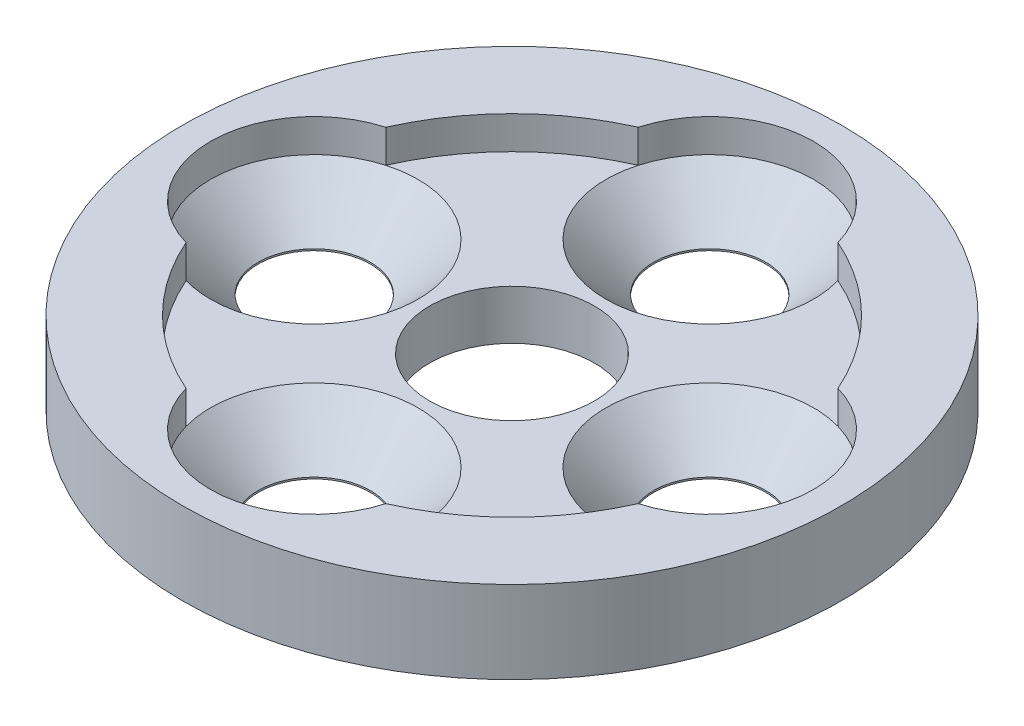
ISO-10303-21;
HEADER;
FILE_DESCRIPTION(('STEP AP214'),'2;1');
FILE_NAME('part.step','',(''),(''),'','','');
FILE_SCHEMA(('AUTOMOTIVE_DESIGN { 1 0 10303 214 1 1 1 1 }'));
ENDSEC;
DATA;
#1=APPLICATION_CONTEXT('core data for automotive mechanical design processes');
#2=APPLICATION_PROTOCOL_DEFINITION('international standard','automotive_design',2000,#1);
#3=PRODUCT_CONTEXT('',#1,'mechanical');
#4=PRODUCT('Part','Part','',(#3));
#5=PRODUCT_RELATED_PRODUCT_CATEGORY('part','',(#4));
#6=PRODUCT_DEFINITION_FORMATION('','',#4);
#7=PRODUCT_DEFINITION_CONTEXT('part definition',#1,'design');
#8=PRODUCT_DEFINITION('design','',#6,#7);
#9=PRODUCT_DEFINITION_SHAPE('','',#8);
#10=(LENGTH_UNIT() NAMED_UNIT(*) SI_UNIT(.MILLI.,.METRE.));
#11=(NAMED_UNIT(*) PLANE_ANGLE_UNIT() SI_UNIT($,.RADIAN.));
#12=(NAMED_UNIT(*) SI_UNIT($,.STERADIAN.) SOLID_ANGLE_UNIT());
#13=UNCERTAINTY_MEASURE_WITH_UNIT(LENGTH_MEASURE(1.E-05),#10,'distance_accuracy_value','');
#14=(GEOMETRIC_REPRESENTATION_CONTEXT(3) GLOBAL_UNCERTAINTY_ASSIGNED_CONTEXT((#13)) GLOBAL_UNIT_ASSIGNED_CONTEXT((#10,
#11,#12)) REPRESENTATION_CONTEXT('',''));
#15=CARTESIAN_POINT('',(0.,0.,0.));
#16=DIRECTION('',(0.,0.,1.));
#17=DIRECTION('',(1.,0.,0.));
#18=AXIS2_PLACEMENT_3D('',#15,#16,#17);
#19=CARTESIAN_POINT('',(0.,2.5,0.));
#20=DIRECTION('',(0.,-1.,0.));
#21=DIRECTION('',(0.,0.,-1.));
#22=AXIS2_PLACEMENT_3D('',#19,#20,#21);
#23=CYLINDRICAL_SURFACE('',#22,7.5);
#24=CARTESIAN_POINT('',(0.,2.5,0.));
#25=DIRECTION('',(0.,1.,0.));
#26=DIRECTION('',(0.,0.,1.));
#27=AXIS2_PLACEMENT_3D('',#24,#25,#26);
#28=CIRCLE('',#27,7.5);
#29=CARTESIAN_POINT('',(-3.03015257196317,2.5,-6.860625));
#30=VERTEX_POINT('',#29);
#31=CARTESIAN_POINT('',(-6.860625,2.5,-3.03015257196317));
#32=VERTEX_POINT('',#31);
#33=EDGE_CURVE('E124',#30,#32,#28,.T.);
#34=ORIENTED_EDGE('',*,*,#33,.T.);
#35=DIRECTION('',(0.,-1.,0.));
#36=VECTOR('',#35,1.);
#37=CARTESIAN_POINT('',(-6.860625,12.,-3.03015257196317));
#38=LINE('',#37,#36);
#39=CARTESIAN_POINT('',(-6.860625,1.5,-3.03015257196317));
#40=VERTEX_POINT('',#39);
#41=EDGE_CURVE('E108',#32,#40,#38,.T.);
#42=ORIENTED_EDGE('',*,*,#41,.T.);
#43=CARTESIAN_POINT('',(0.,1.5,0.));
#44=DIRECTION('',(0.,1.,0.));
#45=DIRECTION('',(0.,0.,1.));
#46=AXIS2_PLACEMENT_3D('',#43,#44,#45);
#47=CIRCLE('',#46,7.5);
#48=CARTESIAN_POINT('',(-3.03015257196317,1.5,-6.860625));
#49=VERTEX_POINT('',#48);
#50=EDGE_CURVE('E48',#40,#49,#47,.F.);
#51=ORIENTED_EDGE('',*,*,#50,.T.);
#52=DIRECTION('',(0.,-1.,0.));
#53=VECTOR('',#52,1.);
#54=CARTESIAN_POINT('',(-3.03015257196317,12.,-6.860625));
#55=LINE('',#54,#53);
#56=EDGE_CURVE('E56',#49,#30,#55,.F.);
#57=ORIENTED_EDGE('',*,*,#56,.T.);
#58=EDGE_LOOP('',(#34,#42,#51,#57));
#59=FACE_BOUND('',#58,.T.);
#60=ADVANCED_FACE('F38',(#59),#23,.F.);
#61=CARTESIAN_POINT('',(-3.03015257196317,1.5,6.860625));
#62=VERTEX_POINT('',#61);
#63=CARTESIAN_POINT('',(-6.860625,1.5,3.03015257196317));
#64=VERTEX_POINT('',#63);
#65=EDGE_CURVE('E11',#62,#64,#47,.F.);
#66=ORIENTED_EDGE('',*,*,#65,.T.);
#67=DIRECTION('',(0.,-1.,0.));
#68=VECTOR('',#67,1.);
#69=CARTESIAN_POINT('',(-6.860625,12.,3.03015257196317));
#70=LINE('',#69,#68);
#71=CARTESIAN_POINT('',(-6.860625,2.5,3.03015257196317));
#72=VERTEX_POINT('',#71);
#73=EDGE_CURVE('E111',#64,#72,#70,.F.);
#74=ORIENTED_EDGE('',*,*,#73,.T.);
#75=CARTESIAN_POINT('',(-3.03015257196317,2.5,6.860625));
#76=VERTEX_POINT('',#75);
#77=EDGE_CURVE('E155',#72,#76,#28,.T.);
#78=ORIENTED_EDGE('',*,*,#77,.T.);
#79=DIRECTION('',(0.,-1.,0.));
#80=VECTOR('',#79,1.);
#81=CARTESIAN_POINT('',(-3.03015257196317,12.,6.860625));
#82=LINE('',#81,#80);
#83=EDGE_CURVE('E132',#76,#62,#82,.T.);
#84=ORIENTED_EDGE('',*,*,#83,.T.);
#85=EDGE_LOOP('',(#66,#74,#78,#84));
#86=FACE_BOUND('',#85,.T.);
#87=ADVANCED_FACE('F262',(#86),#23,.F.);
#88=CARTESIAN_POINT('',(6.860625,1.5,3.03015257196317));
#89=VERTEX_POINT('',#88);
#90=CARTESIAN_POINT('',(3.03015257196317,1.5,6.860625));
#91=VERTEX_POINT('',#90);
#92=EDGE_CURVE('E49',#89,#91,#47,.F.);
#93=ORIENTED_EDGE('',*,*,#92,.T.);
#94=DIRECTION('',(0.,-1.,0.));
#95=VECTOR('',#94,1.);
#96=CARTESIAN_POINT('',(3.03015257196317,12.,6.860625));
#97=LINE('',#96,#95);
#98=CARTESIAN_POINT('',(3.03015257196317,2.5,6.860625));
#99=VERTEX_POINT('',#98);
#100=EDGE_CURVE('E207',#91,#99,#97,.F.);
#101=ORIENTED_EDGE('',*,*,#100,.T.);
#102=CARTESIAN_POINT('',(6.860625,2.5,3.03015257196317));
#103=VERTEX_POINT('',#102);
#104=EDGE_CURVE('E150',#99,#103,#28,.T.);
#105=ORIENTED_EDGE('',*,*,#104,.T.);
#106=DIRECTION('',(0.,-1.,0.));
#107=VECTOR('',#106,1.);
#108=CARTESIAN_POINT('',(6.860625,12.,3.03015257196317));
#109=LINE('',#108,#107);
#110=EDGE_CURVE('E211',#103,#89,#109,.T.);
#111=ORIENTED_EDGE('',*,*,#110,.T.);
#112=EDGE_LOOP('',(#93,#101,#105,#111));
#113=FACE_BOUND('',#112,.T.);
#114=ADVANCED_FACE('F268',(#113),#23,.F.);
#115=CARTESIAN_POINT('',(6.860625,2.5,-3.03015257196317));
#116=VERTEX_POINT('',#115);
#117=CARTESIAN_POINT('',(3.03015257196317,2.5,-6.860625));
#118=VERTEX_POINT('',#117);
#119=EDGE_CURVE('E154',#116,#118,#28,.T.);
#120=ORIENTED_EDGE('',*,*,#119,.T.);
#121=DIRECTION('',(0.,-1.,0.));
#122=VECTOR('',#121,1.);
#123=CARTESIAN_POINT('',(3.03015257196317,12.,-6.860625));
#124=LINE('',#123,#122);
#125=CARTESIAN_POINT('',(3.03015257196317,1.5,-6.860625));
#126=VERTEX_POINT('',#125);
#127=EDGE_CURVE('E221',#118,#126,#124,.T.);
#128=ORIENTED_EDGE('',*,*,#127,.T.);
#129=CARTESIAN_POINT('',(6.860625,1.5,-3.03015257196317));
#130=VERTEX_POINT('',#129);
#131=EDGE_CURVE('E139',#126,#130,#47,.F.);
#132=ORIENTED_EDGE('',*,*,#131,.T.);
#133=DIRECTION('',(0.,-1.,0.));
#134=VECTOR('',#133,1.);
#135=CARTESIAN_POINT('',(6.860625,12.,-3.03015257196317));
#136=LINE('',#135,#134);
#137=EDGE_CURVE('E64',#130,#116,#136,.F.);
#138=ORIENTED_EDGE('',*,*,#137,.T.);
#139=EDGE_LOOP('',(#120,#128,#132,#138));
#140=FACE_BOUND('',#139,.T.);
#141=ADVANCED_FACE('F264',(#140),#23,.F.);
#142=CARTESIAN_POINT('',(0.,1.5,0.));
#143=DIRECTION('',(0.,-1.,0.));
#144=DIRECTION('',(0.,0.,-1.));
#145=AXIS2_PLACEMENT_3D('',#142,#143,#144);
#146=CYLINDRICAL_SURFACE('',#145,10.);
#147=CARTESIAN_POINT('',(0.,0.,0.));
#148=DIRECTION('',(0.,1.,0.));
#149=DIRECTION('',(0.,0.,1.));
#150=AXIS2_PLACEMENT_3D('',#147,#148,#149);
#151=CIRCLE('',#150,10.);
#152=CARTESIAN_POINT('',(0.,0.,10.));
#153=VERTEX_POINT('',#152);
#154=EDGE_CURVE('E142',#153,#153,#151,.T.);
#155=ORIENTED_EDGE('',*,*,#154,.T.);
#156=EDGE_LOOP('',(#155));
#157=FACE_BOUND('',#156,.T.);
#158=CARTESIAN_POINT('',(0.,2.5,0.));
#159=DIRECTION('',(0.,1.,0.));
#160=DIRECTION('',(0.,0.,1.));
#161=AXIS2_PLACEMENT_3D('',#158,#159,#160);
#162=CIRCLE('',#161,10.);
#163=CARTESIAN_POINT('',(0.,2.5,10.));
#164=VERTEX_POINT('',#163);
#165=EDGE_CURVE('E146',#164,#164,#162,.T.);
#166=ORIENTED_EDGE('',*,*,#165,.F.);
#167=EDGE_LOOP('',(#166));
#168=FACE_BOUND('',#167,.T.);
#169=ADVANCED_FACE('F40',(#157,#168),#146,.T.);
#170=CARTESIAN_POINT('',(0.,0.,0.));
#171=DIRECTION('',(0.,1.,0.));
#172=DIRECTION('',(0.,0.,1.));
#173=AXIS2_PLACEMENT_3D('',#170,#171,#172);
#174=PLANE('',#173);
#175=CARTESIAN_POINT('',(0.,0.,0.));
#176=DIRECTION('',(0.,1.,0.));
#177=DIRECTION('',(0.,0.,1.));
#178=AXIS2_PLACEMENT_3D('',#175,#176,#177);
#179=CIRCLE('',#178,2.5);
#180=CARTESIAN_POINT('',(0.,0.,2.5));
#181=VERTEX_POINT('',#180);
#182=EDGE_CURVE('E235',#181,#181,#179,.T.);
#183=ORIENTED_EDGE('',*,*,#182,.T.);
#184=EDGE_LOOP('',(#183));
#185=FACE_BOUND('',#184,.T.);
#186=CARTESIAN_POINT('',(-6.,0.,0.));
#187=DIRECTION('',(0.,1.,0.));
#188=DIRECTION('',(0.,0.,1.));
#189=AXIS2_PLACEMENT_3D('',#186,#187,#188);
#190=CIRCLE('',#189,1.7);
#191=CARTESIAN_POINT('',(-6.,0.,1.7));
#192=VERTEX_POINT('',#191);
#193=EDGE_CURVE('E193',#192,#192,#190,.T.);
#194=ORIENTED_EDGE('',*,*,#193,.T.);
#195=EDGE_LOOP('',(#194));
#196=FACE_BOUND('',#195,.T.);
#197=CARTESIAN_POINT('',(0.,0.,-6.));
#198=DIRECTION('',(0.,1.,0.));
#199=DIRECTION('',(0.,0.,1.));
#200=AXIS2_PLACEMENT_3D('',#197,#198,#199);
#201=CIRCLE('',#200,1.7);
#202=CARTESIAN_POINT('',(0.,0.,-4.3));
#203=VERTEX_POINT('',#202);
#204=EDGE_CURVE('E182',#203,#203,#201,.T.);
#205=ORIENTED_EDGE('',*,*,#204,.T.);
#206=EDGE_LOOP('',(#205));
#207=FACE_BOUND('',#206,.T.);
#208=CARTESIAN_POINT('',(6.,0.,0.));
#209=DIRECTION('',(0.,1.,0.));
#210=DIRECTION('',(0.,0.,1.));
#211=AXIS2_PLACEMENT_3D('',#208,#209,#210);
#212=CIRCLE('',#211,1.7);
#213=CARTESIAN_POINT('',(6.,0.,1.7));
#214=VERTEX_POINT('',#213);
#215=EDGE_CURVE('E169',#214,#214,#212,.T.);
#216=ORIENTED_EDGE('',*,*,#215,.T.);
#217=EDGE_LOOP('',(#216));
#218=FACE_BOUND('',#217,.T.);
#219=CARTESIAN_POINT('',(0.,0.,6.));
#220=DIRECTION('',(0.,1.,0.));
#221=DIRECTION('',(0.,0.,1.));
#222=AXIS2_PLACEMENT_3D('',#219,#220,#221);
#223=CIRCLE('',#222,1.7);
#224=CARTESIAN_POINT('',(0.,0.,7.7));
#225=VERTEX_POINT('',#224);
#226=EDGE_CURVE('E156',#225,#225,#223,.T.);
#227=ORIENTED_EDGE('',*,*,#226,.T.);
#228=EDGE_LOOP('',(#227));
#229=FACE_BOUND('',#228,.T.);
#230=ORIENTED_EDGE('',*,*,#154,.F.);
#231=EDGE_LOOP('',(#230));
#232=FACE_BOUND('',#231,.T.);
#233=ADVANCED_FACE('F258',(#185,#196,#207,#218,#229,#232),#174,.F.);
#234=CARTESIAN_POINT('',(0.,2.5,0.));
#235=DIRECTION('',(0.,1.,0.));
#236=DIRECTION('',(0.,0.,1.));
#237=AXIS2_PLACEMENT_3D('',#234,#235,#236);
#238=PLANE('',#237);
#239=ORIENTED_EDGE('',*,*,#165,.T.);
#240=EDGE_LOOP('',(#239));
#241=FACE_BOUND('',#240,.T.);
#242=ORIENTED_EDGE('',*,*,#77,.F.);
#243=CARTESIAN_POINT('',(-6.,2.5,0.));
#244=DIRECTION('',(0.,1.,0.));
#245=DIRECTION('',(0.,0.,1.));
#246=AXIS2_PLACEMENT_3D('',#243,#244,#245);
#247=CIRCLE('',#246,3.15);
#248=EDGE_CURVE('E126',#72,#32,#247,.F.);
#249=ORIENTED_EDGE('',*,*,#248,.T.);
#250=ORIENTED_EDGE('',*,*,#33,.F.);
#251=CARTESIAN_POINT('',(0.,2.5,-6.));
#252=DIRECTION('',(0.,1.,0.));
#253=DIRECTION('',(0.,0.,1.));
#254=AXIS2_PLACEMENT_3D('',#251,#252,#253);
#255=CIRCLE('',#254,3.15);
#256=EDGE_CURVE('E225',#30,#118,#255,.F.);
#257=ORIENTED_EDGE('',*,*,#256,.T.);
#258=ORIENTED_EDGE('',*,*,#119,.F.);
#259=CARTESIAN_POINT('',(6.,2.5,0.));
#260=DIRECTION('',(0.,1.,0.));
#261=DIRECTION('',(0.,0.,1.));
#262=AXIS2_PLACEMENT_3D('',#259,#260,#261);
#263=CIRCLE('',#262,3.15);
#264=EDGE_CURVE('E215',#116,#103,#263,.F.);
#265=ORIENTED_EDGE('',*,*,#264,.T.);
#266=ORIENTED_EDGE('',*,*,#104,.F.);
#267=CARTESIAN_POINT('',(0.,2.5,6.));
#268=DIRECTION('',(0.,1.,0.));
#269=DIRECTION('',(0.,0.,1.));
#270=AXIS2_PLACEMENT_3D('',#267,#268,#269);
#271=CIRCLE('',#270,3.15);
#272=EDGE_CURVE('E203',#99,#76,#271,.F.);
#273=ORIENTED_EDGE('',*,*,#272,.T.);
#274=EDGE_LOOP('',(#242,#249,#250,#257,#258,#265,#266,#273));
#275=FACE_BOUND('',#274,.T.);
#276=ADVANCED_FACE('F249',(#241,#275),#238,.T.);
#277=CARTESIAN_POINT('',(0.,1.5,0.));
#278=DIRECTION('',(0.,1.,0.));
#279=DIRECTION('',(0.,0.,1.));
#280=AXIS2_PLACEMENT_3D('',#277,#278,#279);
#281=PLANE('',#280);
#282=CARTESIAN_POINT('',(0.,1.5,0.));
#283=DIRECTION('',(0.,1.,0.));
#284=DIRECTION('',(0.,0.,1.));
#285=AXIS2_PLACEMENT_3D('',#282,#283,#284);
#286=CIRCLE('',#285,2.5);
#287=CARTESIAN_POINT('',(0.,1.5,2.5));
#288=VERTEX_POINT('',#287);
#289=EDGE_CURVE('E42',#288,#288,#286,.T.);
#290=ORIENTED_EDGE('',*,*,#289,.F.);
#291=EDGE_LOOP('',(#290));
#292=FACE_BOUND('',#291,.T.);
#293=CARTESIAN_POINT('',(-6.,1.5,0.));
#294=DIRECTION('',(0.,1.,0.));
#295=DIRECTION('',(0.,0.,1.));
#296=AXIS2_PLACEMENT_3D('',#293,#294,#295);
#297=CIRCLE('',#296,3.15);
#298=EDGE_CURVE('E117',#64,#40,#297,.T.);
#299=ORIENTED_EDGE('',*,*,#298,.F.);
#300=ORIENTED_EDGE('',*,*,#65,.F.);
#301=CARTESIAN_POINT('',(0.,1.5,6.));
#302=DIRECTION('',(0.,1.,0.));
#303=DIRECTION('',(0.,0.,1.));
#304=AXIS2_PLACEMENT_3D('',#301,#302,#303);
#305=CIRCLE('',#304,3.15);
#306=EDGE_CURVE('E164',#91,#62,#305,.T.);
#307=ORIENTED_EDGE('',*,*,#306,.F.);
#308=ORIENTED_EDGE('',*,*,#92,.F.);
#309=CARTESIAN_POINT('',(6.,1.5,0.));
#310=DIRECTION('',(0.,1.,0.));
#311=DIRECTION('',(0.,0.,1.));
#312=AXIS2_PLACEMENT_3D('',#309,#310,#311);
#313=CIRCLE('',#312,3.15);
#314=EDGE_CURVE('E181',#130,#89,#313,.T.);
#315=ORIENTED_EDGE('',*,*,#314,.F.);
#316=ORIENTED_EDGE('',*,*,#131,.F.);
#317=CARTESIAN_POINT('',(0.,1.5,-6.));
#318=DIRECTION('',(0.,1.,0.));
#319=DIRECTION('',(0.,0.,1.));
#320=AXIS2_PLACEMENT_3D('',#317,#318,#319);
#321=CIRCLE('',#320,3.15);
#322=EDGE_CURVE('E137',#49,#126,#321,.T.);
#323=ORIENTED_EDGE('',*,*,#322,.F.);
#324=ORIENTED_EDGE('',*,*,#50,.F.);
#325=EDGE_LOOP('',(#299,#300,#307,#308,#315,#316,#323,#324));
#326=FACE_BOUND('',#325,.T.);
#327=ADVANCED_FACE('F134',(#292,#326),#281,.T.);
#328=CARTESIAN_POINT('',(0.,1.5,6.));
#329=DIRECTION('',(0.,1.,0.));
#330=DIRECTION('',(0.,0.,1.));
#331=AXIS2_PLACEMENT_3D('',#328,#329,#330);
#332=CYLINDRICAL_SURFACE('',#331,1.7);
#333=ORIENTED_EDGE('',*,*,#226,.F.);
#334=EDGE_LOOP('',(#333));
#335=FACE_BOUND('',#334,.T.);
#336=CARTESIAN_POINT('',(0.,0.0499999999999932,6.));
#337=DIRECTION('',(0.,1.,0.));
#338=DIRECTION('',(0.,0.,1.));
#339=AXIS2_PLACEMENT_3D('',#336,#337,#338);
#340=CIRCLE('',#339,1.7);
#341=CARTESIAN_POINT('',(0.,0.0499999999999932,7.7));
#342=VERTEX_POINT('',#341);
#343=EDGE_CURVE('E160',#342,#342,#340,.T.);
#344=ORIENTED_EDGE('',*,*,#343,.T.);
#345=EDGE_LOOP('',(#344));
#346=FACE_BOUND('',#345,.T.);
#347=ADVANCED_FACE('F248',(#335,#346),#332,.F.);
#348=CARTESIAN_POINT('',(0.,1.5,6.));
#349=DIRECTION('',(0.,1.,0.));
#350=DIRECTION('',(0.,0.,1.));
#351=AXIS2_PLACEMENT_3D('',#348,#349,#350);
#352=CONICAL_SURFACE('',#351,3.15,0.785398163397447);
#353=ORIENTED_EDGE('',*,*,#343,.F.);
#354=EDGE_LOOP('',(#353));
#355=FACE_BOUND('',#354,.T.);
#356=ORIENTED_EDGE('',*,*,#306,.T.);
#357=EDGE_CURVE('E168',#62,#91,#305,.T.);
#358=ORIENTED_EDGE('',*,*,#357,.T.);
#359=EDGE_LOOP('',(#356,#358));
#360=FACE_BOUND('',#359,.T.);
#361=ADVANCED_FACE('F255',(#355,#360),#352,.F.);
#362=CARTESIAN_POINT('',(6.,1.5,0.));
#363=DIRECTION('',(0.,1.,0.));
#364=DIRECTION('',(0.,0.,1.));
#365=AXIS2_PLACEMENT_3D('',#362,#363,#364);
#366=CYLINDRICAL_SURFACE('',#365,1.7);
#367=ORIENTED_EDGE('',*,*,#215,.F.);
#368=EDGE_LOOP('',(#367));
#369=FACE_BOUND('',#368,.T.);
#370=CARTESIAN_POINT('',(6.,0.0499999999999932,0.));
#371=DIRECTION('',(0.,1.,0.));
#372=DIRECTION('',(0.,0.,1.));
#373=AXIS2_PLACEMENT_3D('',#370,#371,#372);
#374=CIRCLE('',#373,1.7);
#375=CARTESIAN_POINT('',(6.,0.0499999999999932,1.7));
#376=VERTEX_POINT('',#375);
#377=EDGE_CURVE('E173',#376,#376,#374,.T.);
#378=ORIENTED_EDGE('',*,*,#377,.T.);
#379=EDGE_LOOP('',(#378));
#380=FACE_BOUND('',#379,.T.);
#381=ADVANCED_FACE('F332',(#369,#380),#366,.F.);
#382=CARTESIAN_POINT('',(6.,1.5,0.));
#383=DIRECTION('',(0.,1.,0.));
#384=DIRECTION('',(0.,0.,1.));
#385=AXIS2_PLACEMENT_3D('',#382,#383,#384);
#386=CONICAL_SURFACE('',#385,3.15,0.785398163397447);
#387=ORIENTED_EDGE('',*,*,#377,.F.);
#388=EDGE_LOOP('',(#387));
#389=FACE_BOUND('',#388,.T.);
#390=EDGE_CURVE('E177',#89,#130,#313,.T.);
#391=ORIENTED_EDGE('',*,*,#390,.T.);
#392=ORIENTED_EDGE('',*,*,#314,.T.);
#393=EDGE_LOOP('',(#391,#392));
#394=FACE_BOUND('',#393,.T.);
#395=ADVANCED_FACE('F303',(#389,#394),#386,.F.);
#396=CARTESIAN_POINT('',(0.,1.5,-6.));
#397=DIRECTION('',(0.,1.,0.));
#398=DIRECTION('',(0.,0.,1.));
#399=AXIS2_PLACEMENT_3D('',#396,#397,#398);
#400=CYLINDRICAL_SURFACE('',#399,1.7);
#401=ORIENTED_EDGE('',*,*,#204,.F.);
#402=EDGE_LOOP('',(#401));
#403=FACE_BOUND('',#402,.T.);
#404=CARTESIAN_POINT('',(0.,0.0499999999999932,-6.));
#405=DIRECTION('',(0.,1.,0.));
#406=DIRECTION('',(0.,0.,1.));
#407=AXIS2_PLACEMENT_3D('',#404,#405,#406);
#408=CIRCLE('',#407,1.7);
#409=CARTESIAN_POINT('',(0.,0.0499999999999932,-4.30000000000001));
#410=VERTEX_POINT('',#409);
#411=EDGE_CURVE('E186',#410,#410,#408,.T.);
#412=ORIENTED_EDGE('',*,*,#411,.T.);
#413=EDGE_LOOP('',(#412));
#414=FACE_BOUND('',#413,.T.);
#415=ADVANCED_FACE('F325',(#403,#414),#400,.F.);
#416=CARTESIAN_POINT('',(0.,1.5,-6.));
#417=DIRECTION('',(0.,1.,0.));
#418=DIRECTION('',(0.,0.,1.));
#419=AXIS2_PLACEMENT_3D('',#416,#417,#418);
#420=CONICAL_SURFACE('',#419,3.15,0.785398163397447);
#421=ORIENTED_EDGE('',*,*,#411,.F.);
#422=EDGE_LOOP('',(#421));
#423=FACE_BOUND('',#422,.T.);
#424=EDGE_CURVE('E190',#126,#49,#321,.T.);
#425=ORIENTED_EDGE('',*,*,#424,.T.);
#426=ORIENTED_EDGE('',*,*,#322,.T.);
#427=EDGE_LOOP('',(#425,#426));
#428=FACE_BOUND('',#427,.T.);
#429=ADVANCED_FACE('F301',(#423,#428),#420,.F.);
#430=CARTESIAN_POINT('',(-6.,1.5,0.));
#431=DIRECTION('',(0.,1.,0.));
#432=DIRECTION('',(0.,0.,1.));
#433=AXIS2_PLACEMENT_3D('',#430,#431,#432);
#434=CYLINDRICAL_SURFACE('',#433,1.7);
#435=ORIENTED_EDGE('',*,*,#193,.F.);
#436=EDGE_LOOP('',(#435));
#437=FACE_BOUND('',#436,.T.);
#438=CARTESIAN_POINT('',(-6.,0.0499999999999932,0.));
#439=DIRECTION('',(0.,1.,0.));
#440=DIRECTION('',(0.,0.,1.));
#441=AXIS2_PLACEMENT_3D('',#438,#439,#440);
#442=CIRCLE('',#441,1.7);
#443=CARTESIAN_POINT('',(-6.,0.0499999999999932,1.7));
#444=VERTEX_POINT('',#443);
#445=EDGE_CURVE('E116',#444,#444,#442,.T.);
#446=ORIENTED_EDGE('',*,*,#445,.T.);
#447=EDGE_LOOP('',(#446));
#448=FACE_BOUND('',#447,.T.);
#449=ADVANCED_FACE('F318',(#437,#448),#434,.F.);
#450=CARTESIAN_POINT('',(-6.,1.5,0.));
#451=DIRECTION('',(0.,1.,0.));
#452=DIRECTION('',(0.,0.,1.));
#453=AXIS2_PLACEMENT_3D('',#450,#451,#452);
#454=CONICAL_SURFACE('',#453,3.15,0.785398163397447);
#455=ORIENTED_EDGE('',*,*,#445,.F.);
#456=EDGE_LOOP('',(#455));
#457=FACE_BOUND('',#456,.T.);
#458=EDGE_CURVE('E105',#40,#64,#297,.T.);
#459=ORIENTED_EDGE('',*,*,#458,.T.);
#460=ORIENTED_EDGE('',*,*,#298,.T.);
#461=EDGE_LOOP('',(#459,#460));
#462=FACE_BOUND('',#461,.T.);
#463=ADVANCED_FACE('F128',(#457,#462),#454,.F.);
#464=CARTESIAN_POINT('',(-6.,22.5,0.));
#465=DIRECTION('',(0.,-1.,0.));
#466=DIRECTION('',(0.,0.,-1.));
#467=AXIS2_PLACEMENT_3D('',#464,#465,#466);
#468=CYLINDRICAL_SURFACE('',#467,3.15);
#469=ORIENTED_EDGE('',*,*,#248,.F.);
#470=ORIENTED_EDGE('',*,*,#73,.F.);
#471=ORIENTED_EDGE('',*,*,#458,.F.);
#472=ORIENTED_EDGE('',*,*,#41,.F.);
#473=EDGE_LOOP('',(#469,#470,#471,#472));
#474=FACE_BOUND('',#473,.T.);
#475=ADVANCED_FACE('F107',(#474),#468,.F.);
#476=CARTESIAN_POINT('',(0.,22.5,-6.));
#477=DIRECTION('',(0.,-1.,0.));
#478=DIRECTION('',(0.,0.,-1.));
#479=AXIS2_PLACEMENT_3D('',#476,#477,#478);
#480=CYLINDRICAL_SURFACE('',#479,3.15);
#481=ORIENTED_EDGE('',*,*,#256,.F.);
#482=ORIENTED_EDGE('',*,*,#56,.F.);
#483=ORIENTED_EDGE('',*,*,#424,.F.);
#484=ORIENTED_EDGE('',*,*,#127,.F.);
#485=EDGE_LOOP('',(#481,#482,#483,#484));
#486=FACE_BOUND('',#485,.T.);
#487=ADVANCED_FACE('F306',(#486),#480,.F.);
#488=CARTESIAN_POINT('',(6.,22.5,0.));
#489=DIRECTION('',(0.,-1.,0.));
#490=DIRECTION('',(0.,0.,-1.));
#491=AXIS2_PLACEMENT_3D('',#488,#489,#490);
#492=CYLINDRICAL_SURFACE('',#491,3.15);
#493=ORIENTED_EDGE('',*,*,#264,.F.);
#494=ORIENTED_EDGE('',*,*,#137,.F.);
#495=ORIENTED_EDGE('',*,*,#390,.F.);
#496=ORIENTED_EDGE('',*,*,#110,.F.);
#497=EDGE_LOOP('',(#493,#494,#495,#496));
#498=FACE_BOUND('',#497,.T.);
#499=ADVANCED_FACE('F304',(#498),#492,.F.);
#500=CARTESIAN_POINT('',(0.,22.5,6.));
#501=DIRECTION('',(0.,-1.,0.));
#502=DIRECTION('',(0.,0.,-1.));
#503=AXIS2_PLACEMENT_3D('',#500,#501,#502);
#504=CYLINDRICAL_SURFACE('',#503,3.15);
#505=ORIENTED_EDGE('',*,*,#272,.F.);
#506=ORIENTED_EDGE('',*,*,#100,.F.);
#507=ORIENTED_EDGE('',*,*,#357,.F.);
#508=ORIENTED_EDGE('',*,*,#83,.F.);
#509=EDGE_LOOP('',(#505,#506,#507,#508));
#510=FACE_BOUND('',#509,.T.);
#511=ADVANCED_FACE('F288',(#510),#504,.F.);
#512=CARTESIAN_POINT('',(0.,0.,0.));
#513=DIRECTION('',(0.,1.,0.));
#514=DIRECTION('',(0.,0.,1.));
#515=AXIS2_PLACEMENT_3D('',#512,#513,#514);
#516=CYLINDRICAL_SURFACE('',#515,2.5);
#517=ORIENTED_EDGE('',*,*,#289,.T.);
#518=EDGE_LOOP('',(#517));
#519=FACE_BOUND('',#518,.T.);
#520=ORIENTED_EDGE('',*,*,#182,.F.);
#521=EDGE_LOOP('',(#520));
#522=FACE_BOUND('',#521,.T.);
#523=ADVANCED_FACE('F244',(#519,#522),#516,.F.);
#524=CLOSED_SHELL('',(#60,#87,#114,#141,#169,#233,#276,#327,#347,#361,#381,#395,#415,#429,#449,
#463,#475,#487,#499,#511,#523));
#525=MANIFOLD_SOLID_BREP('B2',#524);
#526=ADVANCED_BREP_SHAPE_REPRESENTATION('',(#18,#525),#14);
#527=SHAPE_DEFINITION_REPRESENTATION(#9,#526);
ENDSEC;
END-ISO-10303-21;
